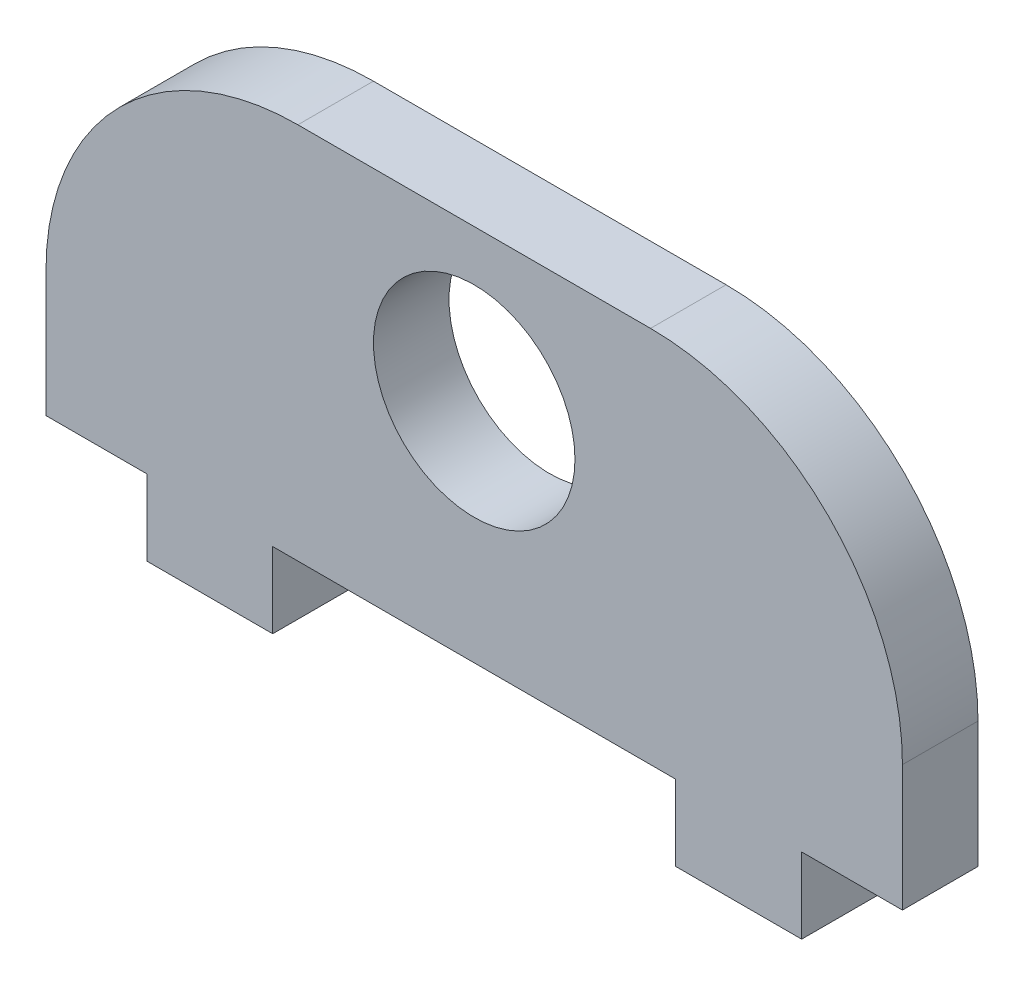
ISO-10303-21;
HEADER;
FILE_DESCRIPTION(('STEP AP214'),'2;1');
FILE_NAME('part.step','',(''),(''),'','','');
FILE_SCHEMA(('AUTOMOTIVE_DESIGN { 1 0 10303 214 1 1 1 1 }'));
ENDSEC;
DATA;
#1=APPLICATION_CONTEXT('core data for automotive mechanical design processes');
#2=APPLICATION_PROTOCOL_DEFINITION('international standard','automotive_design',2000,#1);
#3=PRODUCT_CONTEXT('',#1,'mechanical');
#4=PRODUCT('Part','Part','',(#3));
#5=PRODUCT_RELATED_PRODUCT_CATEGORY('part','',(#4));
#6=PRODUCT_DEFINITION_FORMATION('','',#4);
#7=PRODUCT_DEFINITION_CONTEXT('part definition',#1,'design');
#8=PRODUCT_DEFINITION('design','',#6,#7);
#9=PRODUCT_DEFINITION_SHAPE('','',#8);
#10=(LENGTH_UNIT() NAMED_UNIT(*) SI_UNIT(.MILLI.,.METRE.));
#11=(NAMED_UNIT(*) PLANE_ANGLE_UNIT() SI_UNIT($,.RADIAN.));
#12=(NAMED_UNIT(*) SI_UNIT($,.STERADIAN.) SOLID_ANGLE_UNIT());
#13=UNCERTAINTY_MEASURE_WITH_UNIT(LENGTH_MEASURE(1.E-05),#10,'distance_accuracy_value','');
#14=(GEOMETRIC_REPRESENTATION_CONTEXT(3) GLOBAL_UNCERTAINTY_ASSIGNED_CONTEXT((#13)) GLOBAL_UNIT_ASSIGNED_CONTEXT((#10,
#11,#12)) REPRESENTATION_CONTEXT('',''));
#15=CARTESIAN_POINT('',(0.,0.,0.));
#16=DIRECTION('',(0.,0.,1.));
#17=DIRECTION('',(1.,0.,0.));
#18=AXIS2_PLACEMENT_3D('',#15,#16,#17);
#19=CARTESIAN_POINT('',(0.,0.,3.));
#20=DIRECTION('',(0.,0.,-1.));
#21=DIRECTION('',(-1.,0.,0.));
#22=AXIS2_PLACEMENT_3D('',#19,#20,#21);
#23=PLANE('',#22);
#24=DIRECTION('',(-1.,0.,0.));
#25=VECTOR('',#24,1.);
#26=CARTESIAN_POINT('',(-17.,7.5,3.));
#27=LINE('',#26,#25);
#28=CARTESIAN_POINT('',(7.,7.5,3.));
#29=VERTEX_POINT('',#28);
#30=CARTESIAN_POINT('',(-7.,7.5,3.));
#31=VERTEX_POINT('',#30);
#32=EDGE_CURVE('E157',#29,#31,#27,.T.);
#33=ORIENTED_EDGE('',*,*,#32,.T.);
#34=CARTESIAN_POINT('',(-7.,-2.5,3.));
#35=DIRECTION('',(0.,0.,-1.));
#36=DIRECTION('',(-1.,0.,0.));
#37=AXIS2_PLACEMENT_3D('',#34,#35,#36);
#38=CIRCLE('',#37,10.);
#39=CARTESIAN_POINT('',(-17.,-2.5,3.));
#40=VERTEX_POINT('',#39);
#41=EDGE_CURVE('E52',#31,#40,#38,.F.);
#42=ORIENTED_EDGE('',*,*,#41,.T.);
#43=DIRECTION('',(0.,-1.,0.));
#44=VECTOR('',#43,1.);
#45=CARTESIAN_POINT('',(-17.,-7.5,3.));
#46=LINE('',#45,#44);
#47=CARTESIAN_POINT('',(-17.,-7.5,3.));
#48=VERTEX_POINT('',#47);
#49=EDGE_CURVE('E146',#40,#48,#46,.T.);
#50=ORIENTED_EDGE('',*,*,#49,.T.);
#51=DIRECTION('',(1.,0.,0.));
#52=VECTOR('',#51,1.);
#53=CARTESIAN_POINT('',(-17.,-7.5,3.));
#54=LINE('',#53,#52);
#55=CARTESIAN_POINT('',(-13.,-7.5,3.));
#56=VERTEX_POINT('',#55);
#57=EDGE_CURVE('E150',#48,#56,#54,.T.);
#58=ORIENTED_EDGE('',*,*,#57,.T.);
#59=DIRECTION('',(0.,-1.,0.));
#60=VECTOR('',#59,1.);
#61=CARTESIAN_POINT('',(-13.,-10.5,3.));
#62=LINE('',#61,#60);
#63=CARTESIAN_POINT('',(-13.,-10.5,3.));
#64=VERTEX_POINT('',#63);
#65=EDGE_CURVE('E174',#56,#64,#62,.T.);
#66=ORIENTED_EDGE('',*,*,#65,.T.);
#67=DIRECTION('',(1.,0.,0.));
#68=VECTOR('',#67,1.);
#69=CARTESIAN_POINT('',(-8.,-10.5,3.));
#70=LINE('',#69,#68);
#71=CARTESIAN_POINT('',(-8.,-10.5,3.));
#72=VERTEX_POINT('',#71);
#73=EDGE_CURVE('E177',#64,#72,#70,.T.);
#74=ORIENTED_EDGE('',*,*,#73,.T.);
#75=DIRECTION('',(0.,1.,0.));
#76=VECTOR('',#75,1.);
#77=CARTESIAN_POINT('',(-8.,-7.5,3.));
#78=LINE('',#77,#76);
#79=CARTESIAN_POINT('',(-8.,-7.5,3.));
#80=VERTEX_POINT('',#79);
#81=EDGE_CURVE('E183',#72,#80,#78,.T.);
#82=ORIENTED_EDGE('',*,*,#81,.T.);
#83=DIRECTION('',(1.,0.,0.));
#84=VECTOR('',#83,1.);
#85=CARTESIAN_POINT('',(-8.,-7.5,3.));
#86=LINE('',#85,#84);
#87=CARTESIAN_POINT('',(8.,-7.5,3.));
#88=VERTEX_POINT('',#87);
#89=EDGE_CURVE('E186',#80,#88,#86,.T.);
#90=ORIENTED_EDGE('',*,*,#89,.T.);
#91=DIRECTION('',(0.,-1.,0.));
#92=VECTOR('',#91,1.);
#93=CARTESIAN_POINT('',(8.,-7.5,3.));
#94=LINE('',#93,#92);
#95=CARTESIAN_POINT('',(8.,-10.5,3.));
#96=VERTEX_POINT('',#95);
#97=EDGE_CURVE('E189',#88,#96,#94,.T.);
#98=ORIENTED_EDGE('',*,*,#97,.T.);
#99=DIRECTION('',(1.,0.,0.));
#100=VECTOR('',#99,1.);
#101=CARTESIAN_POINT('',(8.,-10.5,3.));
#102=LINE('',#101,#100);
#103=CARTESIAN_POINT('',(13.,-10.5,3.));
#104=VERTEX_POINT('',#103);
#105=EDGE_CURVE('E192',#96,#104,#102,.T.);
#106=ORIENTED_EDGE('',*,*,#105,.T.);
#107=DIRECTION('',(0.,1.,0.));
#108=VECTOR('',#107,1.);
#109=CARTESIAN_POINT('',(13.,-10.5,3.));
#110=LINE('',#109,#108);
#111=CARTESIAN_POINT('',(13.,-7.5,3.));
#112=VERTEX_POINT('',#111);
#113=EDGE_CURVE('E195',#104,#112,#110,.T.);
#114=ORIENTED_EDGE('',*,*,#113,.T.);
#115=DIRECTION('',(1.,0.,0.));
#116=VECTOR('',#115,1.);
#117=CARTESIAN_POINT('',(13.,-7.5,3.));
#118=LINE('',#117,#116);
#119=CARTESIAN_POINT('',(17.,-7.5,3.));
#120=VERTEX_POINT('',#119);
#121=EDGE_CURVE('E198',#112,#120,#118,.T.);
#122=ORIENTED_EDGE('',*,*,#121,.T.);
#123=DIRECTION('',(0.,1.,0.));
#124=VECTOR('',#123,1.);
#125=CARTESIAN_POINT('',(17.,-7.5,3.));
#126=LINE('',#125,#124);
#127=CARTESIAN_POINT('',(17.,-2.5,3.));
#128=VERTEX_POINT('',#127);
#129=EDGE_CURVE('E238',#120,#128,#126,.T.);
#130=ORIENTED_EDGE('',*,*,#129,.T.);
#131=CARTESIAN_POINT('',(7.,-2.5,3.));
#132=DIRECTION('',(0.,0.,-1.));
#133=DIRECTION('',(-1.,0.,0.));
#134=AXIS2_PLACEMENT_3D('',#131,#132,#133);
#135=CIRCLE('',#134,10.);
#136=EDGE_CURVE('E286',#128,#29,#135,.F.);
#137=ORIENTED_EDGE('',*,*,#136,.T.);
#138=EDGE_LOOP('',(#33,#42,#50,#58,#66,#74,#82,#90,#98,#106,#114,#122,#130,#137));
#139=FACE_BOUND('',#138,.T.);
#140=CARTESIAN_POINT('',(0.,1.5,3.));
#141=DIRECTION('',(0.,0.,1.));
#142=DIRECTION('',(1.,0.,0.));
#143=AXIS2_PLACEMENT_3D('',#140,#141,#142);
#144=CIRCLE('',#143,4.);
#145=CARTESIAN_POINT('',(4.,1.5,3.));
#146=VERTEX_POINT('',#145);
#147=EDGE_CURVE('E206',#146,#146,#144,.T.);
#148=ORIENTED_EDGE('',*,*,#147,.F.);
#149=EDGE_LOOP('',(#148));
#150=FACE_BOUND('',#149,.T.);
#151=ADVANCED_FACE('F43',(#139,#150),#23,.F.);
#152=CARTESIAN_POINT('',(0.,0.,0.));
#153=DIRECTION('',(0.,0.,-1.));
#154=DIRECTION('',(-1.,0.,0.));
#155=AXIS2_PLACEMENT_3D('',#152,#153,#154);
#156=PLANE('',#155);
#157=DIRECTION('',(0.,-1.,0.));
#158=VECTOR('',#157,1.);
#159=CARTESIAN_POINT('',(-17.,-7.5,0.));
#160=LINE('',#159,#158);
#161=CARTESIAN_POINT('',(-17.,-2.5,0.));
#162=VERTEX_POINT('',#161);
#163=CARTESIAN_POINT('',(-17.,-7.5,0.));
#164=VERTEX_POINT('',#163);
#165=EDGE_CURVE('E163',#162,#164,#160,.T.);
#166=ORIENTED_EDGE('',*,*,#165,.F.);
#167=CARTESIAN_POINT('',(-7.,-2.5,0.));
#168=DIRECTION('',(0.,0.,-1.));
#169=DIRECTION('',(-1.,0.,0.));
#170=AXIS2_PLACEMENT_3D('',#167,#168,#169);
#171=CIRCLE('',#170,10.);
#172=CARTESIAN_POINT('',(-7.,7.5,0.));
#173=VERTEX_POINT('',#172);
#174=EDGE_CURVE('E277',#162,#173,#171,.T.);
#175=ORIENTED_EDGE('',*,*,#174,.T.);
#176=DIRECTION('',(-1.,0.,0.));
#177=VECTOR('',#176,1.);
#178=CARTESIAN_POINT('',(-17.,7.5,0.));
#179=LINE('',#178,#177);
#180=CARTESIAN_POINT('',(7.,7.5,0.));
#181=VERTEX_POINT('',#180);
#182=EDGE_CURVE('E205',#181,#173,#179,.T.);
#183=ORIENTED_EDGE('',*,*,#182,.F.);
#184=CARTESIAN_POINT('',(7.,-2.5,0.));
#185=DIRECTION('',(0.,0.,-1.));
#186=DIRECTION('',(-1.,0.,0.));
#187=AXIS2_PLACEMENT_3D('',#184,#185,#186);
#188=CIRCLE('',#187,10.);
#189=CARTESIAN_POINT('',(17.,-2.5,0.));
#190=VERTEX_POINT('',#189);
#191=EDGE_CURVE('E274',#181,#190,#188,.T.);
#192=ORIENTED_EDGE('',*,*,#191,.T.);
#193=DIRECTION('',(0.,1.,0.));
#194=VECTOR('',#193,1.);
#195=CARTESIAN_POINT('',(17.,-7.5,0.));
#196=LINE('',#195,#194);
#197=CARTESIAN_POINT('',(17.,-7.5,0.));
#198=VERTEX_POINT('',#197);
#199=EDGE_CURVE('E202',#198,#190,#196,.T.);
#200=ORIENTED_EDGE('',*,*,#199,.F.);
#201=DIRECTION('',(1.,0.,0.));
#202=VECTOR('',#201,1.);
#203=CARTESIAN_POINT('',(13.,-7.5,0.));
#204=LINE('',#203,#202);
#205=CARTESIAN_POINT('',(13.,-7.5,0.));
#206=VERTEX_POINT('',#205);
#207=EDGE_CURVE('E235',#206,#198,#204,.T.);
#208=ORIENTED_EDGE('',*,*,#207,.F.);
#209=DIRECTION('',(0.,1.,0.));
#210=VECTOR('',#209,1.);
#211=CARTESIAN_POINT('',(13.,-10.5,0.));
#212=LINE('',#211,#210);
#213=CARTESIAN_POINT('',(13.,-10.5,0.));
#214=VERTEX_POINT('',#213);
#215=EDGE_CURVE('E232',#214,#206,#212,.T.);
#216=ORIENTED_EDGE('',*,*,#215,.F.);
#217=DIRECTION('',(1.,0.,0.));
#218=VECTOR('',#217,1.);
#219=CARTESIAN_POINT('',(8.,-10.5,0.));
#220=LINE('',#219,#218);
#221=CARTESIAN_POINT('',(8.,-10.5,0.));
#222=VERTEX_POINT('',#221);
#223=EDGE_CURVE('E229',#222,#214,#220,.T.);
#224=ORIENTED_EDGE('',*,*,#223,.F.);
#225=DIRECTION('',(0.,-1.,0.));
#226=VECTOR('',#225,1.);
#227=CARTESIAN_POINT('',(8.,-7.5,0.));
#228=LINE('',#227,#226);
#229=CARTESIAN_POINT('',(8.,-7.5,0.));
#230=VERTEX_POINT('',#229);
#231=EDGE_CURVE('E226',#230,#222,#228,.T.);
#232=ORIENTED_EDGE('',*,*,#231,.F.);
#233=DIRECTION('',(1.,0.,0.));
#234=VECTOR('',#233,1.);
#235=CARTESIAN_POINT('',(-8.,-7.5,0.));
#236=LINE('',#235,#234);
#237=CARTESIAN_POINT('',(-8.,-7.5,0.));
#238=VERTEX_POINT('',#237);
#239=EDGE_CURVE('E223',#238,#230,#236,.T.);
#240=ORIENTED_EDGE('',*,*,#239,.F.);
#241=DIRECTION('',(0.,1.,0.));
#242=VECTOR('',#241,1.);
#243=CARTESIAN_POINT('',(-8.,-7.5,0.));
#244=LINE('',#243,#242);
#245=CARTESIAN_POINT('',(-8.,-10.5,0.));
#246=VERTEX_POINT('',#245);
#247=EDGE_CURVE('E220',#246,#238,#244,.T.);
#248=ORIENTED_EDGE('',*,*,#247,.F.);
#249=DIRECTION('',(1.,0.,0.));
#250=VECTOR('',#249,1.);
#251=CARTESIAN_POINT('',(-8.,-10.5,0.));
#252=LINE('',#251,#250);
#253=CARTESIAN_POINT('',(-13.,-10.5,0.));
#254=VERTEX_POINT('',#253);
#255=EDGE_CURVE('E217',#254,#246,#252,.T.);
#256=ORIENTED_EDGE('',*,*,#255,.F.);
#257=DIRECTION('',(0.,-1.,0.));
#258=VECTOR('',#257,1.);
#259=CARTESIAN_POINT('',(-13.,-10.5,0.));
#260=LINE('',#259,#258);
#261=CARTESIAN_POINT('',(-13.,-7.5,0.));
#262=VERTEX_POINT('',#261);
#263=EDGE_CURVE('E214',#262,#254,#260,.T.);
#264=ORIENTED_EDGE('',*,*,#263,.F.);
#265=DIRECTION('',(1.,0.,0.));
#266=VECTOR('',#265,1.);
#267=CARTESIAN_POINT('',(-17.,-7.5,0.));
#268=LINE('',#267,#266);
#269=EDGE_CURVE('E211',#164,#262,#268,.T.);
#270=ORIENTED_EDGE('',*,*,#269,.F.);
#271=EDGE_LOOP('',(#166,#175,#183,#192,#200,#208,#216,#224,#232,#240,#248,#256,#264,#270));
#272=FACE_BOUND('',#271,.T.);
#273=CARTESIAN_POINT('',(0.,1.5,0.));
#274=DIRECTION('',(0.,0.,1.));
#275=DIRECTION('',(1.,0.,0.));
#276=AXIS2_PLACEMENT_3D('',#273,#274,#275);
#277=CIRCLE('',#276,4.);
#278=CARTESIAN_POINT('',(4.,1.5,0.));
#279=VERTEX_POINT('',#278);
#280=EDGE_CURVE('E516',#279,#279,#277,.T.);
#281=ORIENTED_EDGE('',*,*,#280,.T.);
#282=EDGE_LOOP('',(#281));
#283=FACE_BOUND('',#282,.T.);
#284=ADVANCED_FACE('F297',(#272,#283),#156,.T.);
#285=CARTESIAN_POINT('',(17.,-7.5,3.));
#286=DIRECTION('',(-1.,0.,0.));
#287=DIRECTION('',(0.,0.,1.));
#288=AXIS2_PLACEMENT_3D('',#285,#286,#287);
#289=PLANE('',#288);
#290=ORIENTED_EDGE('',*,*,#199,.T.);
#291=DIRECTION('',(0.,0.,-1.));
#292=VECTOR('',#291,1.);
#293=CARTESIAN_POINT('',(17.,-2.5,3.));
#294=LINE('',#293,#292);
#295=EDGE_CURVE('E11',#190,#128,#294,.F.);
#296=ORIENTED_EDGE('',*,*,#295,.T.);
#297=ORIENTED_EDGE('',*,*,#129,.F.);
#298=DIRECTION('',(0.,0.,-1.));
#299=VECTOR('',#298,1.);
#300=CARTESIAN_POINT('',(17.,-7.5,3.));
#301=LINE('',#300,#299);
#302=EDGE_CURVE('E201',#120,#198,#301,.T.);
#303=ORIENTED_EDGE('',*,*,#302,.T.);
#304=EDGE_LOOP('',(#290,#296,#297,#303));
#305=FACE_BOUND('',#304,.T.);
#306=ADVANCED_FACE('F300',(#305),#289,.F.);
#307=CARTESIAN_POINT('',(-17.,7.5,3.));
#308=DIRECTION('',(0.,-1.,0.));
#309=DIRECTION('',(0.,0.,-1.));
#310=AXIS2_PLACEMENT_3D('',#307,#308,#309);
#311=PLANE('',#310);
#312=ORIENTED_EDGE('',*,*,#182,.T.);
#313=DIRECTION('',(0.,0.,-1.));
#314=VECTOR('',#313,1.);
#315=CARTESIAN_POINT('',(-7.,7.5,3.));
#316=LINE('',#315,#314);
#317=EDGE_CURVE('E65',#173,#31,#316,.F.);
#318=ORIENTED_EDGE('',*,*,#317,.T.);
#319=ORIENTED_EDGE('',*,*,#32,.F.);
#320=DIRECTION('',(0.,0.,-1.));
#321=VECTOR('',#320,1.);
#322=CARTESIAN_POINT('',(7.,7.5,3.));
#323=LINE('',#322,#321);
#324=EDGE_CURVE('E280',#29,#181,#323,.T.);
#325=ORIENTED_EDGE('',*,*,#324,.T.);
#326=EDGE_LOOP('',(#312,#318,#319,#325));
#327=FACE_BOUND('',#326,.T.);
#328=ADVANCED_FACE('F292',(#327),#311,.F.);
#329=CARTESIAN_POINT('',(-17.,-7.5,3.));
#330=DIRECTION('',(1.,0.,0.));
#331=DIRECTION('',(0.,0.,-1.));
#332=AXIS2_PLACEMENT_3D('',#329,#330,#331);
#333=PLANE('',#332);
#334=ORIENTED_EDGE('',*,*,#49,.F.);
#335=DIRECTION('',(0.,0.,-1.));
#336=VECTOR('',#335,1.);
#337=CARTESIAN_POINT('',(-17.,-2.5,3.));
#338=LINE('',#337,#336);
#339=EDGE_CURVE('E167',#40,#162,#338,.T.);
#340=ORIENTED_EDGE('',*,*,#339,.T.);
#341=ORIENTED_EDGE('',*,*,#165,.T.);
#342=DIRECTION('',(0.,0.,-1.));
#343=VECTOR('',#342,1.);
#344=CARTESIAN_POINT('',(-17.,-7.5,3.));
#345=LINE('',#344,#343);
#346=EDGE_CURVE('E160',#48,#164,#345,.T.);
#347=ORIENTED_EDGE('',*,*,#346,.F.);
#348=EDGE_LOOP('',(#334,#340,#341,#347));
#349=FACE_BOUND('',#348,.T.);
#350=ADVANCED_FACE('F161',(#349),#333,.F.);
#351=CARTESIAN_POINT('',(-17.,-7.5,3.));
#352=DIRECTION('',(0.,1.,0.));
#353=DIRECTION('',(-1.,0.,0.));
#354=AXIS2_PLACEMENT_3D('',#351,#352,#353);
#355=PLANE('',#354);
#356=ORIENTED_EDGE('',*,*,#269,.T.);
#357=DIRECTION('',(0.,0.,-1.));
#358=VECTOR('',#357,1.);
#359=CARTESIAN_POINT('',(-13.,-7.5,3.));
#360=LINE('',#359,#358);
#361=EDGE_CURVE('E168',#56,#262,#360,.T.);
#362=ORIENTED_EDGE('',*,*,#361,.F.);
#363=ORIENTED_EDGE('',*,*,#57,.F.);
#364=ORIENTED_EDGE('',*,*,#346,.T.);
#365=EDGE_LOOP('',(#356,#362,#363,#364));
#366=FACE_BOUND('',#365,.T.);
#367=ADVANCED_FACE('F170',(#366),#355,.F.);
#368=CARTESIAN_POINT('',(-13.,-10.5,3.));
#369=DIRECTION('',(1.,0.,0.));
#370=DIRECTION('',(0.,1.,0.));
#371=AXIS2_PLACEMENT_3D('',#368,#369,#370);
#372=PLANE('',#371);
#373=ORIENTED_EDGE('',*,*,#263,.T.);
#374=DIRECTION('',(0.,0.,-1.));
#375=VECTOR('',#374,1.);
#376=CARTESIAN_POINT('',(-13.,-10.5,3.));
#377=LINE('',#376,#375);
#378=EDGE_CURVE('E266',#64,#254,#377,.T.);
#379=ORIENTED_EDGE('',*,*,#378,.F.);
#380=ORIENTED_EDGE('',*,*,#65,.F.);
#381=ORIENTED_EDGE('',*,*,#361,.T.);
#382=EDGE_LOOP('',(#373,#379,#380,#381));
#383=FACE_BOUND('',#382,.T.);
#384=ADVANCED_FACE('F338',(#383),#372,.F.);
#385=CARTESIAN_POINT('',(-8.,-10.5,3.));
#386=DIRECTION('',(0.,1.,0.));
#387=DIRECTION('',(0.,0.,1.));
#388=AXIS2_PLACEMENT_3D('',#385,#386,#387);
#389=PLANE('',#388);
#390=ORIENTED_EDGE('',*,*,#255,.T.);
#391=DIRECTION('',(0.,0.,-1.));
#392=VECTOR('',#391,1.);
#393=CARTESIAN_POINT('',(-8.,-10.5,3.));
#394=LINE('',#393,#392);
#395=EDGE_CURVE('E262',#72,#246,#394,.T.);
#396=ORIENTED_EDGE('',*,*,#395,.F.);
#397=ORIENTED_EDGE('',*,*,#73,.F.);
#398=ORIENTED_EDGE('',*,*,#378,.T.);
#399=EDGE_LOOP('',(#390,#396,#397,#398));
#400=FACE_BOUND('',#399,.T.);
#401=ADVANCED_FACE('F334',(#400),#389,.F.);
#402=CARTESIAN_POINT('',(-8.,-7.5,3.));
#403=DIRECTION('',(-1.,0.,0.));
#404=DIRECTION('',(0.,0.,1.));
#405=AXIS2_PLACEMENT_3D('',#402,#403,#404);
#406=PLANE('',#405);
#407=ORIENTED_EDGE('',*,*,#247,.T.);
#408=DIRECTION('',(0.,0.,-1.));
#409=VECTOR('',#408,1.);
#410=CARTESIAN_POINT('',(-8.,-7.5,3.));
#411=LINE('',#410,#409);
#412=EDGE_CURVE('E258',#80,#238,#411,.T.);
#413=ORIENTED_EDGE('',*,*,#412,.F.);
#414=ORIENTED_EDGE('',*,*,#81,.F.);
#415=ORIENTED_EDGE('',*,*,#395,.T.);
#416=EDGE_LOOP('',(#407,#413,#414,#415));
#417=FACE_BOUND('',#416,.T.);
#418=ADVANCED_FACE('F330',(#417),#406,.F.);
#419=CARTESIAN_POINT('',(-8.,-7.5,3.));
#420=DIRECTION('',(0.,1.,0.));
#421=DIRECTION('',(-1.,0.,0.));
#422=AXIS2_PLACEMENT_3D('',#419,#420,#421);
#423=PLANE('',#422);
#424=ORIENTED_EDGE('',*,*,#239,.T.);
#425=DIRECTION('',(0.,0.,-1.));
#426=VECTOR('',#425,1.);
#427=CARTESIAN_POINT('',(8.,-7.5,3.));
#428=LINE('',#427,#426);
#429=EDGE_CURVE('E254',#88,#230,#428,.T.);
#430=ORIENTED_EDGE('',*,*,#429,.F.);
#431=ORIENTED_EDGE('',*,*,#89,.F.);
#432=ORIENTED_EDGE('',*,*,#412,.T.);
#433=EDGE_LOOP('',(#424,#430,#431,#432));
#434=FACE_BOUND('',#433,.T.);
#435=ADVANCED_FACE('F325',(#434),#423,.F.);
#436=CARTESIAN_POINT('',(8.,-7.5,3.));
#437=DIRECTION('',(1.,0.,0.));
#438=DIRECTION('',(0.,0.,-1.));
#439=AXIS2_PLACEMENT_3D('',#436,#437,#438);
#440=PLANE('',#439);
#441=ORIENTED_EDGE('',*,*,#231,.T.);
#442=DIRECTION('',(0.,0.,-1.));
#443=VECTOR('',#442,1.);
#444=CARTESIAN_POINT('',(8.,-10.5,3.));
#445=LINE('',#444,#443);
#446=EDGE_CURVE('E250',#96,#222,#445,.T.);
#447=ORIENTED_EDGE('',*,*,#446,.F.);
#448=ORIENTED_EDGE('',*,*,#97,.F.);
#449=ORIENTED_EDGE('',*,*,#429,.T.);
#450=EDGE_LOOP('',(#441,#447,#448,#449));
#451=FACE_BOUND('',#450,.T.);
#452=ADVANCED_FACE('F319',(#451),#440,.F.);
#453=CARTESIAN_POINT('',(8.,-10.5,3.));
#454=DIRECTION('',(0.,1.,0.));
#455=DIRECTION('',(-1.,0.,0.));
#456=AXIS2_PLACEMENT_3D('',#453,#454,#455);
#457=PLANE('',#456);
#458=ORIENTED_EDGE('',*,*,#223,.T.);
#459=DIRECTION('',(0.,0.,-1.));
#460=VECTOR('',#459,1.);
#461=CARTESIAN_POINT('',(13.,-10.5,3.));
#462=LINE('',#461,#460);
#463=EDGE_CURVE('E246',#104,#214,#462,.T.);
#464=ORIENTED_EDGE('',*,*,#463,.F.);
#465=ORIENTED_EDGE('',*,*,#105,.F.);
#466=ORIENTED_EDGE('',*,*,#446,.T.);
#467=EDGE_LOOP('',(#458,#464,#465,#466));
#468=FACE_BOUND('',#467,.T.);
#469=ADVANCED_FACE('F315',(#468),#457,.F.);
#470=CARTESIAN_POINT('',(13.,-10.5,3.));
#471=DIRECTION('',(-1.,0.,0.));
#472=DIRECTION('',(0.,-1.,0.));
#473=AXIS2_PLACEMENT_3D('',#470,#471,#472);
#474=PLANE('',#473);
#475=ORIENTED_EDGE('',*,*,#215,.T.);
#476=DIRECTION('',(0.,0.,-1.));
#477=VECTOR('',#476,1.);
#478=CARTESIAN_POINT('',(13.,-7.5,3.));
#479=LINE('',#478,#477);
#480=EDGE_CURVE('E242',#112,#206,#479,.T.);
#481=ORIENTED_EDGE('',*,*,#480,.F.);
#482=ORIENTED_EDGE('',*,*,#113,.F.);
#483=ORIENTED_EDGE('',*,*,#463,.T.);
#484=EDGE_LOOP('',(#475,#481,#482,#483));
#485=FACE_BOUND('',#484,.T.);
#486=ADVANCED_FACE('F310',(#485),#474,.F.);
#487=CARTESIAN_POINT('',(13.,-7.5,3.));
#488=DIRECTION('',(0.,1.,0.));
#489=DIRECTION('',(0.,0.,1.));
#490=AXIS2_PLACEMENT_3D('',#487,#488,#489);
#491=PLANE('',#490);
#492=ORIENTED_EDGE('',*,*,#207,.T.);
#493=ORIENTED_EDGE('',*,*,#302,.F.);
#494=ORIENTED_EDGE('',*,*,#121,.F.);
#495=ORIENTED_EDGE('',*,*,#480,.T.);
#496=EDGE_LOOP('',(#492,#493,#494,#495));
#497=FACE_BOUND('',#496,.T.);
#498=ADVANCED_FACE('F304',(#497),#491,.F.);
#499=CARTESIAN_POINT('',(0.,1.5,3.));
#500=DIRECTION('',(0.,0.,-1.));
#501=DIRECTION('',(-1.,0.,0.));
#502=AXIS2_PLACEMENT_3D('',#499,#500,#501);
#503=CYLINDRICAL_SURFACE('',#502,4.);
#504=ORIENTED_EDGE('',*,*,#147,.T.);
#505=EDGE_LOOP('',(#504));
#506=FACE_BOUND('',#505,.T.);
#507=ORIENTED_EDGE('',*,*,#280,.F.);
#508=EDGE_LOOP('',(#507));
#509=FACE_BOUND('',#508,.T.);
#510=ADVANCED_FACE('F354',(#506,#509),#503,.F.);
#511=CARTESIAN_POINT('',(-7.,-2.5,3.));
#512=DIRECTION('',(0.,0.,-1.));
#513=DIRECTION('',(-1.,0.,0.));
#514=AXIS2_PLACEMENT_3D('',#511,#512,#513);
#515=CYLINDRICAL_SURFACE('',#514,10.);
#516=ORIENTED_EDGE('',*,*,#41,.F.);
#517=ORIENTED_EDGE('',*,*,#317,.F.);
#518=ORIENTED_EDGE('',*,*,#174,.F.);
#519=ORIENTED_EDGE('',*,*,#339,.F.);
#520=EDGE_LOOP('',(#516,#517,#518,#519));
#521=FACE_BOUND('',#520,.T.);
#522=ADVANCED_FACE('F397',(#521),#515,.T.);
#523=CARTESIAN_POINT('',(7.,-2.5,3.));
#524=DIRECTION('',(0.,0.,-1.));
#525=DIRECTION('',(-1.,0.,0.));
#526=AXIS2_PLACEMENT_3D('',#523,#524,#525);
#527=CYLINDRICAL_SURFACE('',#526,10.);
#528=ORIENTED_EDGE('',*,*,#136,.F.);
#529=ORIENTED_EDGE('',*,*,#295,.F.);
#530=ORIENTED_EDGE('',*,*,#191,.F.);
#531=ORIENTED_EDGE('',*,*,#324,.F.);
#532=EDGE_LOOP('',(#528,#529,#530,#531));
#533=FACE_BOUND('',#532,.T.);
#534=ADVANCED_FACE('F45',(#533),#527,.T.);
#535=CLOSED_SHELL('',(#151,#284,#306,#328,#350,#367,#384,#401,#418,#435,#452,#469,#486,#498,
#510,#522,#534));
#536=MANIFOLD_SOLID_BREP('B2',#535);
#537=ADVANCED_BREP_SHAPE_REPRESENTATION('',(#18,#536),#14);
#538=SHAPE_DEFINITION_REPRESENTATION(#9,#537);
ENDSEC;
END-ISO-10303-21;
